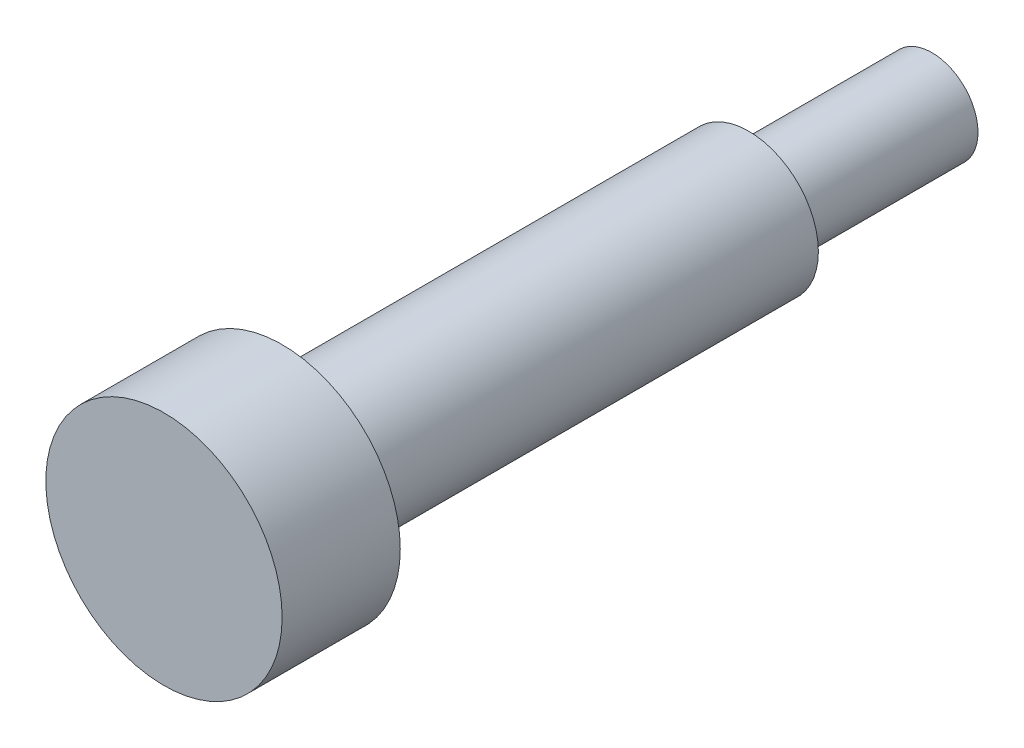
ISO-10303-21;
HEADER;
FILE_DESCRIPTION(('STEP AP214'),'2;1');
FILE_NAME('part.step','',(''),(''),'','','');
FILE_SCHEMA(('AUTOMOTIVE_DESIGN { 1 0 10303 214 1 1 1 1 }'));
ENDSEC;
DATA;
#1=APPLICATION_CONTEXT('core data for automotive mechanical design processes');
#2=APPLICATION_PROTOCOL_DEFINITION('international standard','automotive_design',2000,#1);
#3=PRODUCT_CONTEXT('',#1,'mechanical');
#4=PRODUCT('Part','Part','',(#3));
#5=PRODUCT_RELATED_PRODUCT_CATEGORY('part','',(#4));
#6=PRODUCT_DEFINITION_FORMATION('','',#4);
#7=PRODUCT_DEFINITION_CONTEXT('part definition',#1,'design');
#8=PRODUCT_DEFINITION('design','',#6,#7);
#9=PRODUCT_DEFINITION_SHAPE('','',#8);
#10=(LENGTH_UNIT() NAMED_UNIT(*) SI_UNIT(.MILLI.,.METRE.));
#11=(NAMED_UNIT(*) PLANE_ANGLE_UNIT() SI_UNIT($,.RADIAN.));
#12=(NAMED_UNIT(*) SI_UNIT($,.STERADIAN.) SOLID_ANGLE_UNIT());
#13=UNCERTAINTY_MEASURE_WITH_UNIT(LENGTH_MEASURE(1.E-05),#10,'distance_accuracy_value','');
#14=(GEOMETRIC_REPRESENTATION_CONTEXT(3) GLOBAL_UNCERTAINTY_ASSIGNED_CONTEXT((#13)) GLOBAL_UNIT_ASSIGNED_CONTEXT((#10,
#11,#12)) REPRESENTATION_CONTEXT('',''));
#15=CARTESIAN_POINT('',(0.,0.,0.));
#16=DIRECTION('',(0.,0.,1.));
#17=DIRECTION('',(1.,0.,0.));
#18=AXIS2_PLACEMENT_3D('',#15,#16,#17);
#19=CARTESIAN_POINT('',(0.,0.,7.87400000000001));
#20=DIRECTION('',(0.,0.,-1.));
#21=DIRECTION('',(-1.,0.,0.));
#22=AXIS2_PLACEMENT_3D('',#19,#20,#21);
#23=CYLINDRICAL_SURFACE('',#22,1.9808444);
#24=CARTESIAN_POINT('',(0.,0.,7.87400000000001));
#25=DIRECTION('',(0.,0.,1.));
#26=DIRECTION('',(1.,0.,0.));
#27=AXIS2_PLACEMENT_3D('',#24,#25,#26);
#28=CIRCLE('',#27,1.9808444);
#29=CARTESIAN_POINT('',(1.9808444,0.,7.87400000000001));
#30=VERTEX_POINT('',#29);
#31=EDGE_CURVE('E12',#30,#30,#28,.T.);
#32=ORIENTED_EDGE('',*,*,#31,.F.);
#33=EDGE_LOOP('',(#32));
#34=FACE_BOUND('',#33,.T.);
#35=CARTESIAN_POINT('',(0.,0.,0.));
#36=DIRECTION('',(0.,0.,1.));
#37=DIRECTION('',(1.,0.,0.));
#38=AXIS2_PLACEMENT_3D('',#35,#36,#37);
#39=CIRCLE('',#38,1.9808444);
#40=CARTESIAN_POINT('',(1.9808444,0.,0.));
#41=VERTEX_POINT('',#40);
#42=EDGE_CURVE('E50',#41,#41,#39,.T.);
#43=ORIENTED_EDGE('',*,*,#42,.T.);
#44=EDGE_LOOP('',(#43));
#45=FACE_BOUND('',#44,.T.);
#46=ADVANCED_FACE('F47',(#34,#45),#23,.T.);
#47=CARTESIAN_POINT('',(0.,0.,0.));
#48=DIRECTION('',(0.,0.,1.));
#49=DIRECTION('',(1.,0.,0.));
#50=AXIS2_PLACEMENT_3D('',#47,#48,#49);
#51=PLANE('',#50);
#52=CARTESIAN_POINT('',(0.,0.,0.));
#53=DIRECTION('',(0.,0.,-1.));
#54=DIRECTION('',(-1.,0.,0.));
#55=AXIS2_PLACEMENT_3D('',#52,#53,#54);
#56=CIRCLE('',#55,1.143);
#57=CARTESIAN_POINT('',(-1.143,0.,0.));
#58=VERTEX_POINT('',#57);
#59=EDGE_CURVE('E59',#58,#58,#56,.T.);
#60=ORIENTED_EDGE('',*,*,#59,.F.);
#61=EDGE_LOOP('',(#60));
#62=FACE_BOUND('',#61,.T.);
#63=ORIENTED_EDGE('',*,*,#42,.F.);
#64=EDGE_LOOP('',(#63));
#65=FACE_BOUND('',#64,.T.);
#66=ADVANCED_FACE('F95',(#62,#65),#51,.F.);
#67=CARTESIAN_POINT('',(0.,0.,7.87400000000001));
#68=DIRECTION('',(0.,0.,-1.));
#69=DIRECTION('',(-1.,0.,0.));
#70=AXIS2_PLACEMENT_3D('',#67,#68,#69);
#71=CYLINDRICAL_SURFACE('',#70,1.143);
#72=CARTESIAN_POINT('',(0.,0.,7.87400000000001));
#73=DIRECTION('',(0.,0.,-1.));
#74=DIRECTION('',(-1.,0.,0.));
#75=AXIS2_PLACEMENT_3D('',#72,#73,#74);
#76=CIRCLE('',#75,1.143);
#77=CARTESIAN_POINT('',(-1.143,0.,7.87400000000001));
#78=VERTEX_POINT('',#77);
#79=EDGE_CURVE('E57',#78,#78,#76,.T.);
#80=ORIENTED_EDGE('',*,*,#79,.F.);
#81=EDGE_LOOP('',(#80));
#82=FACE_BOUND('',#81,.T.);
#83=ORIENTED_EDGE('',*,*,#59,.T.);
#84=EDGE_LOOP('',(#83));
#85=FACE_BOUND('',#84,.T.);
#86=ADVANCED_FACE('F100',(#82,#85),#71,.F.);
#87=CARTESIAN_POINT('',(0.,0.,7.87400000000001));
#88=DIRECTION('',(0.,0.,1.));
#89=DIRECTION('',(1.,0.,0.));
#90=AXIS2_PLACEMENT_3D('',#87,#88,#89);
#91=PLANE('',#90);
#92=ORIENTED_EDGE('',*,*,#31,.T.);
#93=EDGE_LOOP('',(#92));
#94=FACE_BOUND('',#93,.T.);
#95=CARTESIAN_POINT('',(0.,0.,7.87400000000001));
#96=DIRECTION('',(0.,0.,1.));
#97=DIRECTION('',(1.,0.,0.));
#98=AXIS2_PLACEMENT_3D('',#95,#96,#97);
#99=CIRCLE('',#98,2.99147738);
#100=CARTESIAN_POINT('',(2.99147738,0.,7.87400000000001));
#101=VERTEX_POINT('',#100);
#102=EDGE_CURVE('E65',#101,#101,#99,.T.);
#103=ORIENTED_EDGE('',*,*,#102,.F.);
#104=EDGE_LOOP('',(#103));
#105=FACE_BOUND('',#104,.T.);
#106=ADVANCED_FACE('F108',(#94,#105),#91,.F.);
#107=CARTESIAN_POINT('',(0.,0.,27.94));
#108=DIRECTION('',(0.,0.,-1.));
#109=DIRECTION('',(-1.,0.,0.));
#110=AXIS2_PLACEMENT_3D('',#107,#108,#109);
#111=CYLINDRICAL_SURFACE('',#110,2.99147738);
#112=CARTESIAN_POINT('',(0.,0.,27.94));
#113=DIRECTION('',(0.,0.,1.));
#114=DIRECTION('',(1.,0.,0.));
#115=AXIS2_PLACEMENT_3D('',#112,#113,#114);
#116=CIRCLE('',#115,2.99147738);
#117=CARTESIAN_POINT('',(2.99147738,0.,27.94));
#118=VERTEX_POINT('',#117);
#119=EDGE_CURVE('E62',#118,#118,#116,.T.);
#120=ORIENTED_EDGE('',*,*,#119,.F.);
#121=EDGE_LOOP('',(#120));
#122=FACE_BOUND('',#121,.T.);
#123=ORIENTED_EDGE('',*,*,#102,.T.);
#124=EDGE_LOOP('',(#123));
#125=FACE_BOUND('',#124,.T.);
#126=ADVANCED_FACE('F113',(#122,#125),#111,.T.);
#127=ORIENTED_EDGE('',*,*,#79,.T.);
#128=EDGE_LOOP('',(#127));
#129=FACE_BOUND('',#128,.T.);
#130=ADVANCED_FACE('F82',(#129),#91,.F.);
#131=CARTESIAN_POINT('',(0.,0.,33.02));
#132=DIRECTION('',(0.,0.,-1.));
#133=DIRECTION('',(-1.,0.,0.));
#134=AXIS2_PLACEMENT_3D('',#131,#132,#133);
#135=CYLINDRICAL_SURFACE('',#134,5.08);
#136=CARTESIAN_POINT('',(0.,0.,33.02));
#137=DIRECTION('',(0.,0.,1.));
#138=DIRECTION('',(1.,0.,0.));
#139=AXIS2_PLACEMENT_3D('',#136,#137,#138);
#140=CIRCLE('',#139,5.08);
#141=CARTESIAN_POINT('',(5.08,0.,33.02));
#142=VERTEX_POINT('',#141);
#143=EDGE_CURVE('E68',#142,#142,#140,.T.);
#144=ORIENTED_EDGE('',*,*,#143,.F.);
#145=EDGE_LOOP('',(#144));
#146=FACE_BOUND('',#145,.T.);
#147=CARTESIAN_POINT('',(0.,0.,27.94));
#148=DIRECTION('',(0.,0.,1.));
#149=DIRECTION('',(1.,0.,0.));
#150=AXIS2_PLACEMENT_3D('',#147,#148,#149);
#151=CIRCLE('',#150,5.08);
#152=CARTESIAN_POINT('',(5.08,0.,27.94));
#153=VERTEX_POINT('',#152);
#154=EDGE_CURVE('E71',#153,#153,#151,.T.);
#155=ORIENTED_EDGE('',*,*,#154,.T.);
#156=EDGE_LOOP('',(#155));
#157=FACE_BOUND('',#156,.T.);
#158=ADVANCED_FACE('F79',(#146,#157),#135,.T.);
#159=CARTESIAN_POINT('',(0.,0.,33.02));
#160=DIRECTION('',(0.,0.,1.));
#161=DIRECTION('',(1.,0.,0.));
#162=AXIS2_PLACEMENT_3D('',#159,#160,#161);
#163=PLANE('',#162);
#164=ORIENTED_EDGE('',*,*,#143,.T.);
#165=EDGE_LOOP('',(#164));
#166=FACE_BOUND('',#165,.T.);
#167=ADVANCED_FACE('F77',(#166),#163,.T.);
#168=CARTESIAN_POINT('',(0.,0.,27.94));
#169=DIRECTION('',(0.,0.,1.));
#170=DIRECTION('',(1.,0.,0.));
#171=AXIS2_PLACEMENT_3D('',#168,#169,#170);
#172=PLANE('',#171);
#173=ORIENTED_EDGE('',*,*,#119,.T.);
#174=EDGE_LOOP('',(#173));
#175=FACE_BOUND('',#174,.T.);
#176=ORIENTED_EDGE('',*,*,#154,.F.);
#177=EDGE_LOOP('',(#176));
#178=FACE_BOUND('',#177,.T.);
#179=ADVANCED_FACE('F86',(#175,#178),#172,.F.);
#180=CLOSED_SHELL('',(#46,#66,#86,#106,#126,#130,#158,#167,#179));
#181=MANIFOLD_SOLID_BREP('B2',#180);
#182=ADVANCED_BREP_SHAPE_REPRESENTATION('',(#18,#181),#14);
#183=SHAPE_DEFINITION_REPRESENTATION(#9,#182);
ENDSEC;
END-ISO-10303-21;
